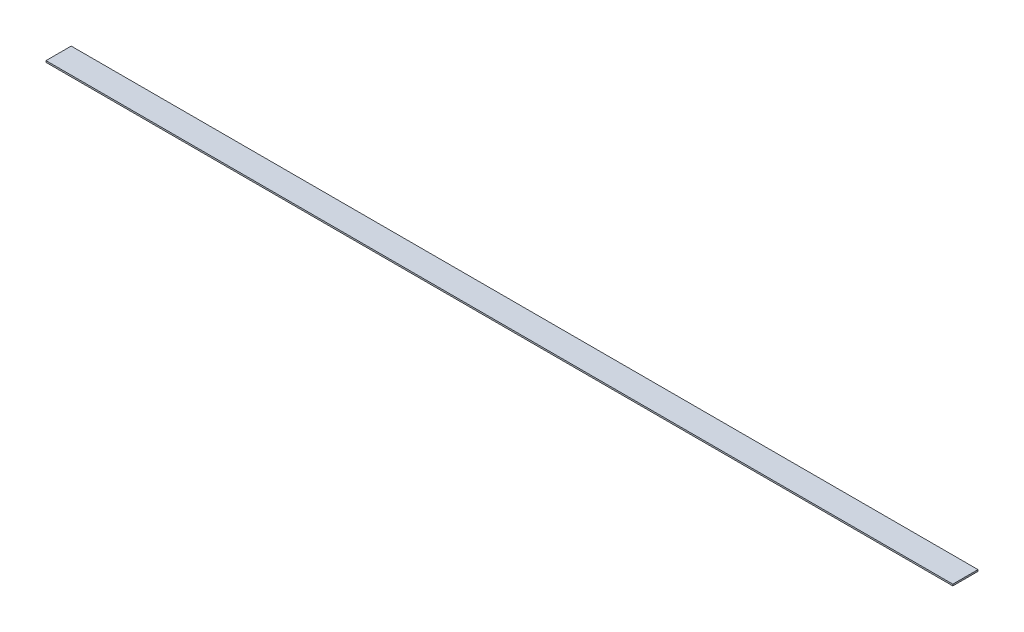
ISO-10303-21;
HEADER;
FILE_DESCRIPTION(('STEP AP214'),'2;1');
FILE_NAME('part.step','',(''),(''),'','','');
FILE_SCHEMA(('AUTOMOTIVE_DESIGN { 1 0 10303 214 1 1 1 1 }'));
ENDSEC;
DATA;
#1=APPLICATION_CONTEXT('core data for automotive mechanical design processes');
#2=APPLICATION_PROTOCOL_DEFINITION('international standard','automotive_design',2000,#1);
#3=PRODUCT_CONTEXT('',#1,'mechanical');
#4=PRODUCT('Part','Part','',(#3));
#5=PRODUCT_RELATED_PRODUCT_CATEGORY('part','',(#4));
#6=PRODUCT_DEFINITION_FORMATION('','',#4);
#7=PRODUCT_DEFINITION_CONTEXT('part definition',#1,'design');
#8=PRODUCT_DEFINITION('design','',#6,#7);
#9=PRODUCT_DEFINITION_SHAPE('','',#8);
#10=(LENGTH_UNIT() NAMED_UNIT(*) SI_UNIT(.MILLI.,.METRE.));
#11=(NAMED_UNIT(*) PLANE_ANGLE_UNIT() SI_UNIT($,.RADIAN.));
#12=(NAMED_UNIT(*) SI_UNIT($,.STERADIAN.) SOLID_ANGLE_UNIT());
#13=UNCERTAINTY_MEASURE_WITH_UNIT(LENGTH_MEASURE(1.E-05),#10,'distance_accuracy_value','');
#14=(GEOMETRIC_REPRESENTATION_CONTEXT(3) GLOBAL_UNCERTAINTY_ASSIGNED_CONTEXT((#13)) GLOBAL_UNIT_ASSIGNED_CONTEXT((#10,
#11,#12)) REPRESENTATION_CONTEXT('',''));
#15=CARTESIAN_POINT('',(0.,0.,0.));
#16=DIRECTION('',(0.,0.,1.));
#17=DIRECTION('',(1.,0.,0.));
#18=AXIS2_PLACEMENT_3D('',#15,#16,#17);
#19=CARTESIAN_POINT('',(0.,1.5875,0.));
#20=DIRECTION('',(1.,0.,0.));
#21=DIRECTION('',(0.,0.,-1.));
#22=AXIS2_PLACEMENT_3D('',#19,#20,#21);
#23=PLANE('',#22);
#24=DIRECTION('',(0.,0.,1.));
#25=VECTOR('',#24,1.);
#26=CARTESIAN_POINT('',(0.,0.,0.));
#27=LINE('',#26,#25);
#28=CARTESIAN_POINT('',(0.,0.,-25.4));
#29=VERTEX_POINT('',#28);
#30=CARTESIAN_POINT('',(0.,0.,0.));
#31=VERTEX_POINT('',#30);
#32=EDGE_CURVE('E115',#29,#31,#27,.T.);
#33=ORIENTED_EDGE('',*,*,#32,.T.);
#34=DIRECTION('',(0.,-1.,0.));
#35=VECTOR('',#34,1.);
#36=CARTESIAN_POINT('',(0.,1.5875,0.));
#37=LINE('',#36,#35);
#38=CARTESIAN_POINT('',(0.,1.5875,0.));
#39=VERTEX_POINT('',#38);
#40=EDGE_CURVE('E11',#39,#31,#37,.T.);
#41=ORIENTED_EDGE('',*,*,#40,.F.);
#42=DIRECTION('',(0.,0.,1.));
#43=VECTOR('',#42,1.);
#44=CARTESIAN_POINT('',(0.,1.5875,0.));
#45=LINE('',#44,#43);
#46=CARTESIAN_POINT('',(0.,1.5875,-25.4));
#47=VERTEX_POINT('',#46);
#48=EDGE_CURVE('E98',#47,#39,#45,.T.);
#49=ORIENTED_EDGE('',*,*,#48,.F.);
#50=DIRECTION('',(0.,-1.,0.));
#51=VECTOR('',#50,1.);
#52=CARTESIAN_POINT('',(0.,1.5875,-25.4));
#53=LINE('',#52,#51);
#54=EDGE_CURVE('E111',#47,#29,#53,.T.);
#55=ORIENTED_EDGE('',*,*,#54,.T.);
#56=EDGE_LOOP('',(#33,#41,#49,#55));
#57=FACE_BOUND('',#56,.T.);
#58=ADVANCED_FACE('F38',(#57),#23,.F.);
#59=CARTESIAN_POINT('',(0.,1.5875,0.));
#60=DIRECTION('',(0.,0.,-1.));
#61=DIRECTION('',(-1.,0.,0.));
#62=AXIS2_PLACEMENT_3D('',#59,#60,#61);
#63=PLANE('',#62);
#64=DIRECTION('',(1.,0.,0.));
#65=VECTOR('',#64,1.);
#66=CARTESIAN_POINT('',(0.,0.,0.));
#67=LINE('',#66,#65);
#68=CARTESIAN_POINT('',(914.4,0.,0.));
#69=VERTEX_POINT('',#68);
#70=EDGE_CURVE('E103',#31,#69,#67,.T.);
#71=ORIENTED_EDGE('',*,*,#70,.T.);
#72=DIRECTION('',(0.,-1.,0.));
#73=VECTOR('',#72,1.);
#74=CARTESIAN_POINT('',(914.4,1.5875,0.));
#75=LINE('',#74,#73);
#76=CARTESIAN_POINT('',(914.4,1.5875,0.));
#77=VERTEX_POINT('',#76);
#78=EDGE_CURVE('E47',#77,#69,#75,.T.);
#79=ORIENTED_EDGE('',*,*,#78,.F.);
#80=DIRECTION('',(1.,0.,0.));
#81=VECTOR('',#80,1.);
#82=CARTESIAN_POINT('',(0.,1.5875,0.));
#83=LINE('',#82,#81);
#84=EDGE_CURVE('E93',#39,#77,#83,.T.);
#85=ORIENTED_EDGE('',*,*,#84,.F.);
#86=ORIENTED_EDGE('',*,*,#40,.T.);
#87=EDGE_LOOP('',(#71,#79,#85,#86));
#88=FACE_BOUND('',#87,.T.);
#89=ADVANCED_FACE('F102',(#88),#63,.F.);
#90=CARTESIAN_POINT('',(914.4,1.5875,0.));
#91=DIRECTION('',(-1.,0.,0.));
#92=DIRECTION('',(0.,0.,1.));
#93=AXIS2_PLACEMENT_3D('',#90,#91,#92);
#94=PLANE('',#93);
#95=DIRECTION('',(0.,0.,-1.));
#96=VECTOR('',#95,1.);
#97=CARTESIAN_POINT('',(914.4,0.,0.));
#98=LINE('',#97,#96);
#99=CARTESIAN_POINT('',(914.4,0.,-25.4));
#100=VERTEX_POINT('',#99);
#101=EDGE_CURVE('E79',#69,#100,#98,.T.);
#102=ORIENTED_EDGE('',*,*,#101,.T.);
#103=DIRECTION('',(0.,-1.,0.));
#104=VECTOR('',#103,1.);
#105=CARTESIAN_POINT('',(914.4,1.5875,-25.4));
#106=LINE('',#105,#104);
#107=CARTESIAN_POINT('',(914.4,1.5875,-25.4));
#108=VERTEX_POINT('',#107);
#109=EDGE_CURVE('E105',#108,#100,#106,.T.);
#110=ORIENTED_EDGE('',*,*,#109,.F.);
#111=DIRECTION('',(0.,0.,-1.));
#112=VECTOR('',#111,1.);
#113=CARTESIAN_POINT('',(914.4,1.5875,0.));
#114=LINE('',#113,#112);
#115=EDGE_CURVE('E96',#77,#108,#114,.T.);
#116=ORIENTED_EDGE('',*,*,#115,.F.);
#117=ORIENTED_EDGE('',*,*,#78,.T.);
#118=EDGE_LOOP('',(#102,#110,#116,#117));
#119=FACE_BOUND('',#118,.T.);
#120=ADVANCED_FACE('F106',(#119),#94,.F.);
#121=CARTESIAN_POINT('',(0.,1.5875,-25.4));
#122=DIRECTION('',(0.,0.,1.));
#123=DIRECTION('',(1.,0.,0.));
#124=AXIS2_PLACEMENT_3D('',#121,#122,#123);
#125=PLANE('',#124);
#126=DIRECTION('',(-1.,0.,0.));
#127=VECTOR('',#126,1.);
#128=CARTESIAN_POINT('',(0.,0.,-25.4));
#129=LINE('',#128,#127);
#130=EDGE_CURVE('E86',#100,#29,#129,.T.);
#131=ORIENTED_EDGE('',*,*,#130,.T.);
#132=ORIENTED_EDGE('',*,*,#54,.F.);
#133=DIRECTION('',(-1.,0.,0.));
#134=VECTOR('',#133,1.);
#135=CARTESIAN_POINT('',(0.,1.5875,-25.4));
#136=LINE('',#135,#134);
#137=EDGE_CURVE('E58',#108,#47,#136,.T.);
#138=ORIENTED_EDGE('',*,*,#137,.F.);
#139=ORIENTED_EDGE('',*,*,#109,.T.);
#140=EDGE_LOOP('',(#131,#132,#138,#139));
#141=FACE_BOUND('',#140,.T.);
#142=ADVANCED_FACE('F127',(#141),#125,.F.);
#143=CARTESIAN_POINT('',(0.,1.5875,0.));
#144=DIRECTION('',(0.,-1.,0.));
#145=DIRECTION('',(0.,0.,-1.));
#146=AXIS2_PLACEMENT_3D('',#143,#144,#145);
#147=PLANE('',#146);
#148=ORIENTED_EDGE('',*,*,#48,.T.);
#149=ORIENTED_EDGE('',*,*,#84,.T.);
#150=ORIENTED_EDGE('',*,*,#115,.T.);
#151=ORIENTED_EDGE('',*,*,#137,.T.);
#152=EDGE_LOOP('',(#148,#149,#150,#151));
#153=FACE_BOUND('',#152,.T.);
#154=ADVANCED_FACE('F94',(#153),#147,.F.);
#155=CARTESIAN_POINT('',(0.,0.,0.));
#156=DIRECTION('',(0.,-1.,0.));
#157=DIRECTION('',(0.,0.,-1.));
#158=AXIS2_PLACEMENT_3D('',#155,#156,#157);
#159=PLANE('',#158);
#160=ORIENTED_EDGE('',*,*,#32,.F.);
#161=ORIENTED_EDGE('',*,*,#130,.F.);
#162=ORIENTED_EDGE('',*,*,#101,.F.);
#163=ORIENTED_EDGE('',*,*,#70,.F.);
#164=EDGE_LOOP('',(#160,#161,#162,#163));
#165=FACE_BOUND('',#164,.T.);
#166=ADVANCED_FACE('F130',(#165),#159,.T.);
#167=CLOSED_SHELL('',(#58,#89,#120,#142,#154,#166));
#168=MANIFOLD_SOLID_BREP('B2',#167);
#169=ADVANCED_BREP_SHAPE_REPRESENTATION('',(#18,#168),#14);
#170=SHAPE_DEFINITION_REPRESENTATION(#9,#169);
ENDSEC;
END-ISO-10303-21;
